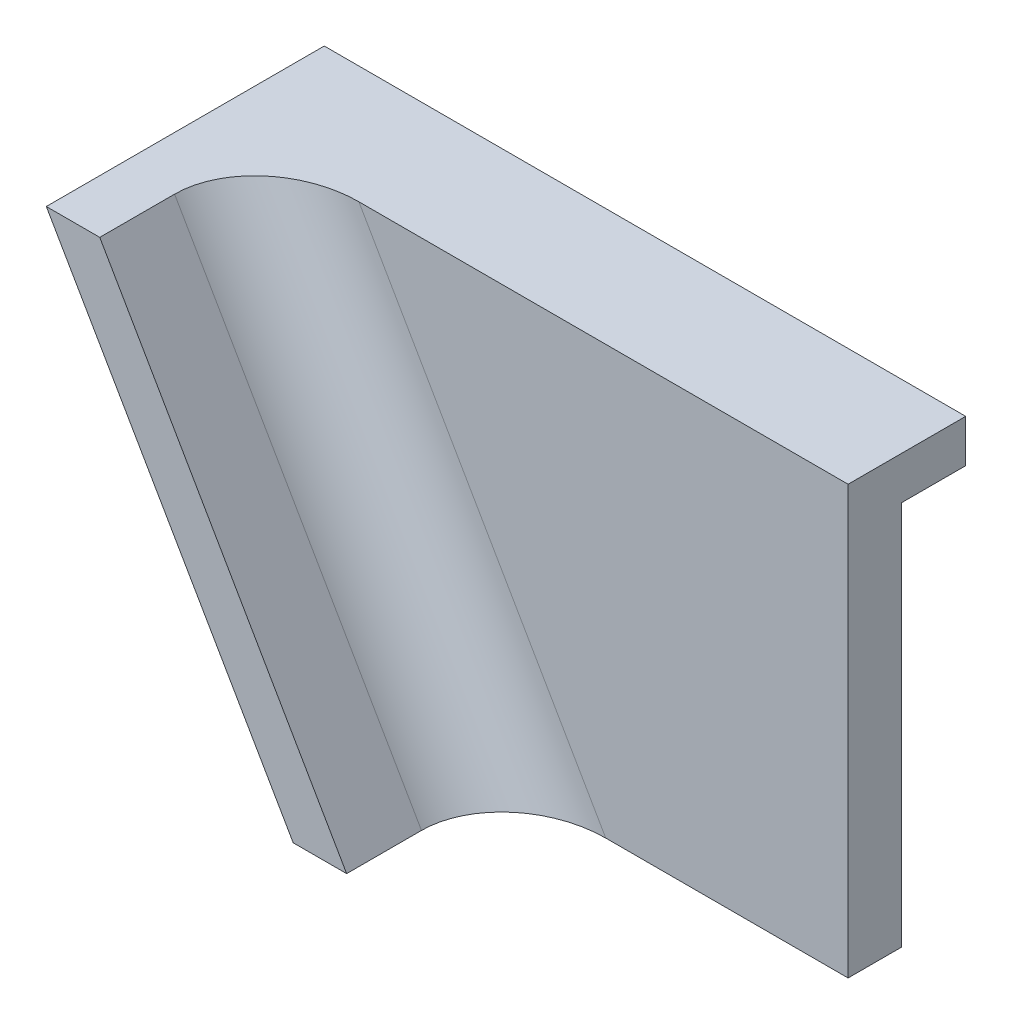
ISO-10303-21;
HEADER;
FILE_DESCRIPTION(('STEP AP214'),'2;1');
FILE_NAME('part.step','',(''),(''),'','','');
FILE_SCHEMA(('AUTOMOTIVE_DESIGN { 1 0 10303 214 1 1 1 1 }'));
ENDSEC;
DATA;
#1=APPLICATION_CONTEXT('core data for automotive mechanical design processes');
#2=APPLICATION_PROTOCOL_DEFINITION('international standard','automotive_design',2000,#1);
#3=PRODUCT_CONTEXT('',#1,'mechanical');
#4=PRODUCT('Part','Part','',(#3));
#5=PRODUCT_RELATED_PRODUCT_CATEGORY('part','',(#4));
#6=PRODUCT_DEFINITION_FORMATION('','',#4);
#7=PRODUCT_DEFINITION_CONTEXT('part definition',#1,'design');
#8=PRODUCT_DEFINITION('design','',#6,#7);
#9=PRODUCT_DEFINITION_SHAPE('','',#8);
#10=(LENGTH_UNIT() NAMED_UNIT(*) SI_UNIT(.MILLI.,.METRE.));
#11=(NAMED_UNIT(*) PLANE_ANGLE_UNIT() SI_UNIT($,.RADIAN.));
#12=(NAMED_UNIT(*) SI_UNIT($,.STERADIAN.) SOLID_ANGLE_UNIT());
#13=UNCERTAINTY_MEASURE_WITH_UNIT(LENGTH_MEASURE(1.E-05),#10,'distance_accuracy_value','');
#14=(GEOMETRIC_REPRESENTATION_CONTEXT(3) GLOBAL_UNCERTAINTY_ASSIGNED_CONTEXT((#13)) GLOBAL_UNIT_ASSIGNED_CONTEXT((#10,
#11,#12)) REPRESENTATION_CONTEXT('',''));
#15=CARTESIAN_POINT('',(0.,0.,0.));
#16=DIRECTION('',(0.,0.,1.));
#17=DIRECTION('',(1.,0.,0.));
#18=AXIS2_PLACEMENT_3D('',#15,#16,#17);
#19=CARTESIAN_POINT('',(0.,0.,6.35));
#20=DIRECTION('',(0.,0.,-1.));
#21=DIRECTION('',(-1.,0.,0.));
#22=AXIS2_PLACEMENT_3D('',#19,#20,#21);
#23=PLANE('',#22);
#24=DIRECTION('',(-1.,0.,0.));
#25=VECTOR('',#24,1.);
#26=CARTESIAN_POINT('',(0.,0.,6.35));
#27=LINE('',#26,#25);
#28=CARTESIAN_POINT('',(76.2,0.,6.35));
#29=VERTEX_POINT('',#28);
#30=CARTESIAN_POINT('',(18.0817574699332,0.,6.35));
#31=VERTEX_POINT('',#30);
#32=EDGE_CURVE('E152',#29,#31,#27,.T.);
#33=ORIENTED_EDGE('',*,*,#32,.T.);
#34=DIRECTION('',(-0.499999999999998,0.86602540378444,0.));
#35=VECTOR('',#34,1.);
#36=CARTESIAN_POINT('',(44.4782117772828,-45.72,6.35));
#37=LINE('',#36,#35);
#38=CARTESIAN_POINT('',(47.411151144766,-50.8,6.35));
#39=VERTEX_POINT('',#38);
#40=EDGE_CURVE('E54',#31,#39,#37,.F.);
#41=ORIENTED_EDGE('',*,*,#40,.T.);
#42=DIRECTION('',(1.,0.,0.));
#43=VECTOR('',#42,1.);
#44=CARTESIAN_POINT('',(76.2,-50.8,6.35));
#45=LINE('',#44,#43);
#46=CARTESIAN_POINT('',(76.2,-50.8,6.35));
#47=VERTEX_POINT('',#46);
#48=EDGE_CURVE('E141',#39,#47,#45,.T.);
#49=ORIENTED_EDGE('',*,*,#48,.T.);
#50=DIRECTION('',(0.,1.,0.));
#51=VECTOR('',#50,1.);
#52=CARTESIAN_POINT('',(76.2,0.,6.35));
#53=LINE('',#52,#51);
#54=EDGE_CURVE('E144',#47,#29,#53,.T.);
#55=ORIENTED_EDGE('',*,*,#54,.T.);
#56=EDGE_LOOP('',(#33,#41,#49,#55));
#57=FACE_BOUND('',#56,.T.);
#58=ADVANCED_FACE('F33',(#57),#23,.F.);
#59=CARTESIAN_POINT('',(0.,0.,0.));
#60=DIRECTION('',(0.,0.,-1.));
#61=DIRECTION('',(-1.,0.,0.));
#62=AXIS2_PLACEMENT_3D('',#59,#60,#61);
#63=PLANE('',#62);
#64=DIRECTION('',(0.499999999999998,-0.86602540378444,0.));
#65=VECTOR('',#64,1.);
#66=CARTESIAN_POINT('',(0.,0.,0.));
#67=LINE('',#66,#65);
#68=CARTESIAN_POINT('',(2.93293936748328,-5.08,0.));
#69=VERTEX_POINT('',#68);
#70=CARTESIAN_POINT('',(29.3293936748328,-50.8,0.));
#71=VERTEX_POINT('',#70);
#72=EDGE_CURVE('E168',#69,#71,#67,.T.);
#73=ORIENTED_EDGE('',*,*,#72,.F.);
#74=DIRECTION('',(1.,0.,0.));
#75=VECTOR('',#74,1.);
#76=CARTESIAN_POINT('',(76.2,-5.08,0.));
#77=LINE('',#76,#75);
#78=CARTESIAN_POINT('',(76.2,-5.08,0.));
#79=VERTEX_POINT('',#78);
#80=EDGE_CURVE('E127',#69,#79,#77,.T.);
#81=ORIENTED_EDGE('',*,*,#80,.T.);
#82=DIRECTION('',(0.,1.,0.));
#83=VECTOR('',#82,1.);
#84=CARTESIAN_POINT('',(76.2,0.,0.));
#85=LINE('',#84,#83);
#86=CARTESIAN_POINT('',(76.2,-50.8,0.));
#87=VERTEX_POINT('',#86);
#88=EDGE_CURVE('E145',#87,#79,#85,.T.);
#89=ORIENTED_EDGE('',*,*,#88,.F.);
#90=DIRECTION('',(1.,0.,0.));
#91=VECTOR('',#90,1.);
#92=CARTESIAN_POINT('',(76.2,-50.8,0.));
#93=LINE('',#92,#91);
#94=EDGE_CURVE('E173',#71,#87,#93,.T.);
#95=ORIENTED_EDGE('',*,*,#94,.F.);
#96=EDGE_LOOP('',(#73,#81,#89,#95));
#97=FACE_BOUND('',#96,.T.);
#98=ADVANCED_FACE('F191',(#97),#63,.T.);
#99=CARTESIAN_POINT('',(0.,0.,6.35));
#100=DIRECTION('',(0.86602540378444,0.499999999999998,0.));
#101=DIRECTION('',(-0.499999999999998,0.86602540378444,0.));
#102=AXIS2_PLACEMENT_3D('',#99,#100,#101);
#103=PLANE('',#102);
#104=DIRECTION('',(0.,0.,-1.));
#105=VECTOR('',#104,1.);
#106=CARTESIAN_POINT('',(0.,0.,6.35));
#107=LINE('',#106,#105);
#108=CARTESIAN_POINT('',(0.,0.,25.4));
#109=VERTEX_POINT('',#108);
#110=CARTESIAN_POINT('',(0.,0.,-7.62));
#111=VERTEX_POINT('',#110);
#112=EDGE_CURVE('E159',#109,#111,#107,.T.);
#113=ORIENTED_EDGE('',*,*,#112,.T.);
#114=DIRECTION('',(0.499999999999998,-0.86602540378444,0.));
#115=VECTOR('',#114,1.);
#116=CARTESIAN_POINT('',(0.,0.,-7.62));
#117=LINE('',#116,#115);
#118=CARTESIAN_POINT('',(2.93293936748328,-5.08,-7.62));
#119=VERTEX_POINT('',#118);
#120=EDGE_CURVE('E207',#111,#119,#117,.T.);
#121=ORIENTED_EDGE('',*,*,#120,.T.);
#122=DIRECTION('',(0.,0.,1.));
#123=VECTOR('',#122,1.);
#124=CARTESIAN_POINT('',(2.93293936748328,-5.08,-7.62));
#125=LINE('',#124,#123);
#126=EDGE_CURVE('E162',#119,#69,#125,.T.);
#127=ORIENTED_EDGE('',*,*,#126,.T.);
#128=ORIENTED_EDGE('',*,*,#72,.T.);
#129=DIRECTION('',(0.,0.,-1.));
#130=VECTOR('',#129,1.);
#131=CARTESIAN_POINT('',(29.3293936748328,-50.8,6.35));
#132=LINE('',#131,#130);
#133=CARTESIAN_POINT('',(29.3293936748328,-50.8,25.4));
#134=VERTEX_POINT('',#133);
#135=EDGE_CURVE('E140',#134,#71,#132,.T.);
#136=ORIENTED_EDGE('',*,*,#135,.F.);
#137=DIRECTION('',(0.499999999999998,-0.86602540378444,0.));
#138=VECTOR('',#137,1.);
#139=CARTESIAN_POINT('',(0.,0.,25.4));
#140=LINE('',#139,#138);
#141=EDGE_CURVE('E121',#109,#134,#140,.T.);
#142=ORIENTED_EDGE('',*,*,#141,.F.);
#143=EDGE_LOOP('',(#113,#121,#127,#128,#136,#142));
#144=FACE_BOUND('',#143,.T.);
#145=ADVANCED_FACE('F185',(#144),#103,.F.);
#146=CARTESIAN_POINT('',(76.2,-50.8,6.35));
#147=DIRECTION('',(0.,1.,0.));
#148=DIRECTION('',(-1.,0.,0.));
#149=AXIS2_PLACEMENT_3D('',#146,#147,#148);
#150=PLANE('',#149);
#151=ORIENTED_EDGE('',*,*,#94,.T.);
#152=DIRECTION('',(0.,0.,-1.));
#153=VECTOR('',#152,1.);
#154=CARTESIAN_POINT('',(76.2,-50.8,6.35));
#155=LINE('',#154,#153);
#156=EDGE_CURVE('E180',#47,#87,#155,.T.);
#157=ORIENTED_EDGE('',*,*,#156,.F.);
#158=ORIENTED_EDGE('',*,*,#48,.F.);
#159=CARTESIAN_POINT('',(47.411151144766,-50.8,16.51));
#160=DIRECTION('',(0.,1.,0.));
#161=DIRECTION('',(1.,0.,0.));
#162=AXIS2_PLACEMENT_3D('',#159,#160,#161);
#163=ELLIPSE('',#162,11.7317574699332,10.16);
#164=CARTESIAN_POINT('',(35.6793936748328,-50.8,16.51));
#165=VERTEX_POINT('',#164);
#166=EDGE_CURVE('E11',#39,#165,#163,.T.);
#167=ORIENTED_EDGE('',*,*,#166,.T.);
#168=DIRECTION('',(0.,0.,-1.));
#169=VECTOR('',#168,1.);
#170=CARTESIAN_POINT('',(35.6793936748328,-50.8,25.4));
#171=LINE('',#170,#169);
#172=CARTESIAN_POINT('',(35.6793936748328,-50.8,25.4));
#173=VERTEX_POINT('',#172);
#174=EDGE_CURVE('E108',#173,#165,#171,.T.);
#175=ORIENTED_EDGE('',*,*,#174,.F.);
#176=DIRECTION('',(1.,0.,0.));
#177=VECTOR('',#176,1.);
#178=CARTESIAN_POINT('',(0.,-50.8,25.4));
#179=LINE('',#178,#177);
#180=EDGE_CURVE('E115',#134,#173,#179,.T.);
#181=ORIENTED_EDGE('',*,*,#180,.F.);
#182=ORIENTED_EDGE('',*,*,#135,.T.);
#183=EDGE_LOOP('',(#151,#157,#158,#167,#175,#181,#182));
#184=FACE_BOUND('',#183,.T.);
#185=ADVANCED_FACE('F125',(#184),#150,.F.);
#186=CARTESIAN_POINT('',(76.2,0.,6.35));
#187=DIRECTION('',(-1.,0.,0.));
#188=DIRECTION('',(0.,-1.,0.));
#189=AXIS2_PLACEMENT_3D('',#186,#187,#188);
#190=PLANE('',#189);
#191=ORIENTED_EDGE('',*,*,#88,.T.);
#192=DIRECTION('',(0.,0.,1.));
#193=VECTOR('',#192,1.);
#194=CARTESIAN_POINT('',(76.2,-5.08,-7.62));
#195=LINE('',#194,#193);
#196=CARTESIAN_POINT('',(76.2,-5.08,-7.62));
#197=VERTEX_POINT('',#196);
#198=EDGE_CURVE('E164',#197,#79,#195,.T.);
#199=ORIENTED_EDGE('',*,*,#198,.F.);
#200=DIRECTION('',(0.,1.,0.));
#201=VECTOR('',#200,1.);
#202=CARTESIAN_POINT('',(76.2,0.,-7.62));
#203=LINE('',#202,#201);
#204=CARTESIAN_POINT('',(76.2,0.,-7.62));
#205=VERTEX_POINT('',#204);
#206=EDGE_CURVE('E130',#197,#205,#203,.T.);
#207=ORIENTED_EDGE('',*,*,#206,.T.);
#208=DIRECTION('',(0.,0.,-1.));
#209=VECTOR('',#208,1.);
#210=CARTESIAN_POINT('',(76.2,0.,6.35));
#211=LINE('',#210,#209);
#212=EDGE_CURVE('E178',#29,#205,#211,.T.);
#213=ORIENTED_EDGE('',*,*,#212,.F.);
#214=ORIENTED_EDGE('',*,*,#54,.F.);
#215=ORIENTED_EDGE('',*,*,#156,.T.);
#216=EDGE_LOOP('',(#191,#199,#207,#213,#214,#215));
#217=FACE_BOUND('',#216,.T.);
#218=ADVANCED_FACE('F193',(#217),#190,.F.);
#219=CARTESIAN_POINT('',(0.,0.,6.35));
#220=DIRECTION('',(0.,-1.,0.));
#221=DIRECTION('',(0.,0.,-1.));
#222=AXIS2_PLACEMENT_3D('',#219,#220,#221);
#223=PLANE('',#222);
#224=ORIENTED_EDGE('',*,*,#212,.T.);
#225=DIRECTION('',(-1.,0.,0.));
#226=VECTOR('',#225,1.);
#227=CARTESIAN_POINT('',(76.2,0.,-7.62));
#228=LINE('',#227,#226);
#229=EDGE_CURVE('E205',#205,#111,#228,.T.);
#230=ORIENTED_EDGE('',*,*,#229,.T.);
#231=ORIENTED_EDGE('',*,*,#112,.F.);
#232=DIRECTION('',(1.,0.,0.));
#233=VECTOR('',#232,1.);
#234=CARTESIAN_POINT('',(0.,0.,25.4));
#235=LINE('',#234,#233);
#236=CARTESIAN_POINT('',(6.35,0.,25.4));
#237=VERTEX_POINT('',#236);
#238=EDGE_CURVE('E114',#109,#237,#235,.T.);
#239=ORIENTED_EDGE('',*,*,#238,.T.);
#240=DIRECTION('',(0.,0.,-1.));
#241=VECTOR('',#240,1.);
#242=CARTESIAN_POINT('',(6.35,0.,25.4));
#243=LINE('',#242,#241);
#244=CARTESIAN_POINT('',(6.35,0.,16.51));
#245=VERTEX_POINT('',#244);
#246=EDGE_CURVE('E110',#237,#245,#243,.T.);
#247=ORIENTED_EDGE('',*,*,#246,.T.);
#248=CARTESIAN_POINT('',(18.0817574699332,0.,16.51));
#249=DIRECTION('',(0.,-1.,0.));
#250=DIRECTION('',(1.,0.,0.));
#251=AXIS2_PLACEMENT_3D('',#248,#249,#250);
#252=ELLIPSE('',#251,11.7317574699332,10.16);
#253=EDGE_CURVE('E41',#245,#31,#252,.T.);
#254=ORIENTED_EDGE('',*,*,#253,.T.);
#255=ORIENTED_EDGE('',*,*,#32,.F.);
#256=EDGE_LOOP('',(#224,#230,#231,#239,#247,#254,#255));
#257=FACE_BOUND('',#256,.T.);
#258=ADVANCED_FACE('F199',(#257),#223,.F.);
#259=CARTESIAN_POINT('',(76.2,-5.08,-7.62));
#260=DIRECTION('',(0.,-1.,0.));
#261=DIRECTION('',(1.,0.,0.));
#262=AXIS2_PLACEMENT_3D('',#259,#260,#261);
#263=PLANE('',#262);
#264=ORIENTED_EDGE('',*,*,#80,.F.);
#265=ORIENTED_EDGE('',*,*,#126,.F.);
#266=DIRECTION('',(1.,0.,0.));
#267=VECTOR('',#266,1.);
#268=CARTESIAN_POINT('',(76.2,-5.08,-7.62));
#269=LINE('',#268,#267);
#270=EDGE_CURVE('E165',#119,#197,#269,.T.);
#271=ORIENTED_EDGE('',*,*,#270,.T.);
#272=ORIENTED_EDGE('',*,*,#198,.T.);
#273=EDGE_LOOP('',(#264,#265,#271,#272));
#274=FACE_BOUND('',#273,.T.);
#275=ADVANCED_FACE('F211',(#274),#263,.T.);
#276=CARTESIAN_POINT('',(0.,0.,-7.62));
#277=DIRECTION('',(0.,0.,-1.));
#278=DIRECTION('',(-1.,0.,0.));
#279=AXIS2_PLACEMENT_3D('',#276,#277,#278);
#280=PLANE('',#279);
#281=ORIENTED_EDGE('',*,*,#206,.F.);
#282=ORIENTED_EDGE('',*,*,#270,.F.);
#283=ORIENTED_EDGE('',*,*,#120,.F.);
#284=ORIENTED_EDGE('',*,*,#229,.F.);
#285=EDGE_LOOP('',(#281,#282,#283,#284));
#286=FACE_BOUND('',#285,.T.);
#287=ADVANCED_FACE('F214',(#286),#280,.T.);
#288=CARTESIAN_POINT('',(4.76250000000001,2.74963065701559,25.4));
#289=DIRECTION('',(-0.86602540378444,-0.499999999999998,0.));
#290=DIRECTION('',(0.499999999999998,-0.86602540378444,0.));
#291=AXIS2_PLACEMENT_3D('',#288,#289,#290);
#292=PLANE('',#291);
#293=ORIENTED_EDGE('',*,*,#174,.T.);
#294=DIRECTION('',(-0.499999999999998,0.86602540378444,0.));
#295=VECTOR('',#294,1.);
#296=CARTESIAN_POINT('',(6.35,0.,16.51));
#297=LINE('',#296,#295);
#298=EDGE_CURVE('E138',#165,#245,#297,.T.);
#299=ORIENTED_EDGE('',*,*,#298,.T.);
#300=ORIENTED_EDGE('',*,*,#246,.F.);
#301=DIRECTION('',(-0.499999999999998,0.86602540378444,0.));
#302=VECTOR('',#301,1.);
#303=CARTESIAN_POINT('',(4.76250000000001,2.74963065701559,25.4));
#304=LINE('',#303,#302);
#305=EDGE_CURVE('E103',#173,#237,#304,.T.);
#306=ORIENTED_EDGE('',*,*,#305,.F.);
#307=EDGE_LOOP('',(#293,#299,#300,#306));
#308=FACE_BOUND('',#307,.T.);
#309=ADVANCED_FACE('F105',(#308),#292,.F.);
#310=CARTESIAN_POINT('',(0.,0.,25.4));
#311=DIRECTION('',(0.,0.,1.));
#312=DIRECTION('',(1.,0.,0.));
#313=AXIS2_PLACEMENT_3D('',#310,#311,#312);
#314=PLANE('',#313);
#315=ORIENTED_EDGE('',*,*,#180,.T.);
#316=ORIENTED_EDGE('',*,*,#305,.T.);
#317=ORIENTED_EDGE('',*,*,#238,.F.);
#318=ORIENTED_EDGE('',*,*,#141,.T.);
#319=EDGE_LOOP('',(#315,#316,#317,#318));
#320=FACE_BOUND('',#319,.T.);
#321=ADVANCED_FACE('F119',(#320),#314,.T.);
#322=CARTESIAN_POINT('',(13.5613181024499,7.82963065701557,16.51));
#323=DIRECTION('',(0.499999999999998,-0.86602540378444,0.));
#324=DIRECTION('',(0.86602540378444,0.499999999999998,0.));
#325=AXIS2_PLACEMENT_3D('',#322,#323,#324);
#326=CYLINDRICAL_SURFACE('',#325,10.16);
#327=ORIENTED_EDGE('',*,*,#166,.F.);
#328=ORIENTED_EDGE('',*,*,#40,.F.);
#329=ORIENTED_EDGE('',*,*,#253,.F.);
#330=ORIENTED_EDGE('',*,*,#298,.F.);
#331=EDGE_LOOP('',(#327,#328,#329,#330));
#332=FACE_BOUND('',#331,.T.);
#333=ADVANCED_FACE('F35',(#332),#326,.F.);
#334=CLOSED_SHELL('',(#58,#98,#145,#185,#218,#258,#275,#287,#309,#321,#333));
#335=MANIFOLD_SOLID_BREP('B2',#334);
#336=ADVANCED_BREP_SHAPE_REPRESENTATION('',(#18,#335),#14);
#337=SHAPE_DEFINITION_REPRESENTATION(#9,#336);
ENDSEC;
END-ISO-10303-21;
